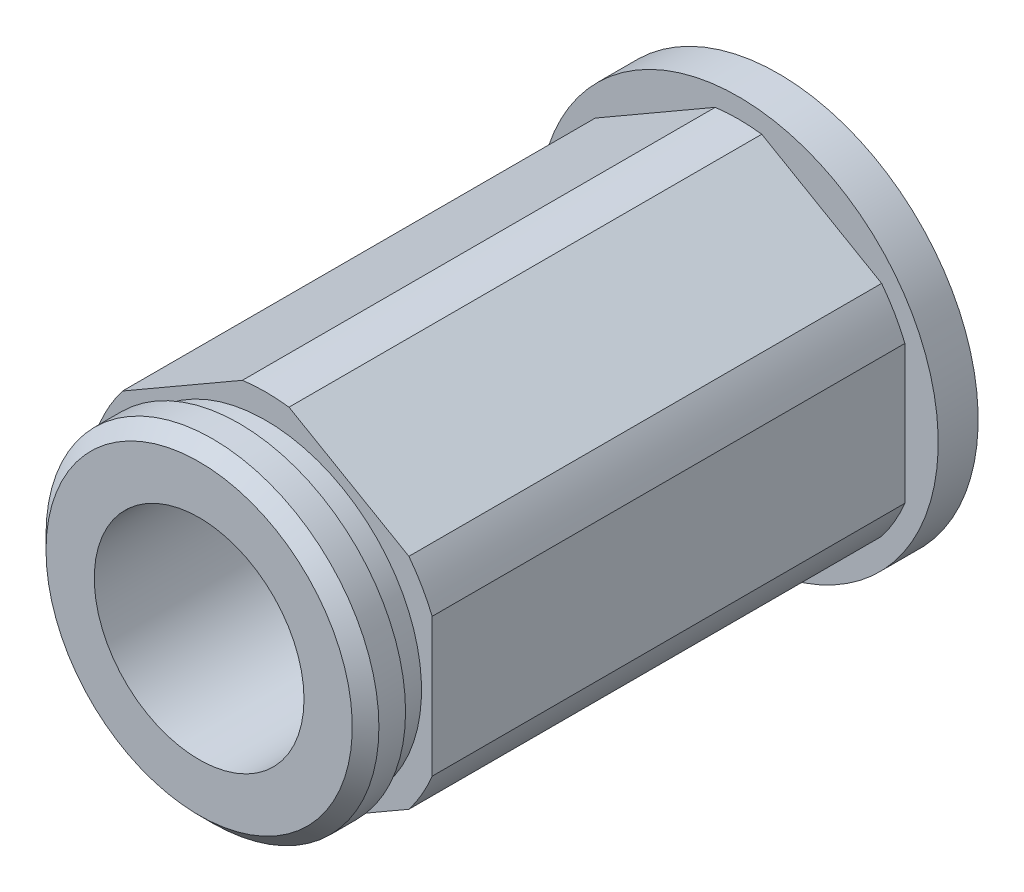
ISO-10303-21;
HEADER;
FILE_DESCRIPTION(('STEP AP214'),'2;1');
FILE_NAME('part.step','',(''),(''),'','','');
FILE_SCHEMA(('AUTOMOTIVE_DESIGN { 1 0 10303 214 1 1 1 1 }'));
ENDSEC;
DATA;
#1=APPLICATION_CONTEXT('core data for automotive mechanical design processes');
#2=APPLICATION_PROTOCOL_DEFINITION('international standard','automotive_design',2000,#1);
#3=PRODUCT_CONTEXT('',#1,'mechanical');
#4=PRODUCT('Part','Part','',(#3));
#5=PRODUCT_RELATED_PRODUCT_CATEGORY('part','',(#4));
#6=PRODUCT_DEFINITION_FORMATION('','',#4);
#7=PRODUCT_DEFINITION_CONTEXT('part definition',#1,'design');
#8=PRODUCT_DEFINITION('design','',#6,#7);
#9=PRODUCT_DEFINITION_SHAPE('','',#8);
#10=(LENGTH_UNIT() NAMED_UNIT(*) SI_UNIT(.MILLI.,.METRE.));
#11=(NAMED_UNIT(*) PLANE_ANGLE_UNIT() SI_UNIT($,.RADIAN.));
#12=(NAMED_UNIT(*) SI_UNIT($,.STERADIAN.) SOLID_ANGLE_UNIT());
#13=UNCERTAINTY_MEASURE_WITH_UNIT(LENGTH_MEASURE(1.E-05),#10,'distance_accuracy_value','');
#14=(GEOMETRIC_REPRESENTATION_CONTEXT(3) GLOBAL_UNCERTAINTY_ASSIGNED_CONTEXT((#13)) GLOBAL_UNIT_ASSIGNED_CONTEXT((#10,
#11,#12)) REPRESENTATION_CONTEXT('',''));
#15=CARTESIAN_POINT('',(0.,0.,0.));
#16=DIRECTION('',(0.,0.,1.));
#17=DIRECTION('',(1.,0.,0.));
#18=AXIS2_PLACEMENT_3D('',#15,#16,#17);
#19=CARTESIAN_POINT('',(-0.88841137786549,6.81942387054648,9.779));
#20=DIRECTION('',(0.5,-0.866025403784439,0.));
#21=DIRECTION('',(0.866025403784439,0.5,0.));
#22=AXIS2_PLACEMENT_3D('',#19,#20,#21);
#23=PLANE('',#22);
#24=DIRECTION('',(0.866025403784439,0.5,0.));
#25=VECTOR('',#24,1.);
#26=CARTESIAN_POINT('',(-0.88841137786549,6.81942387054648,-8.255));
#27=LINE('',#26,#25);
#28=CARTESIAN_POINT('',(-5.46158862213451,4.17909875751589,-8.255));
#29=VERTEX_POINT('',#28);
#30=CARTESIAN_POINT('',(-0.88841137786549,6.81942387054648,-8.255));
#31=VERTEX_POINT('',#30);
#32=EDGE_CURVE('E167',#29,#31,#27,.T.);
#33=ORIENTED_EDGE('',*,*,#32,.F.);
#34=DIRECTION('',(0.,0.,-1.));
#35=VECTOR('',#34,1.);
#36=CARTESIAN_POINT('',(-5.46158862213451,4.17909875751589,9.779));
#37=LINE('',#36,#35);
#38=CARTESIAN_POINT('',(-5.46158862213451,4.17909875751589,9.779));
#39=VERTEX_POINT('',#38);
#40=EDGE_CURVE('E49',#39,#29,#37,.T.);
#41=ORIENTED_EDGE('',*,*,#40,.F.);
#42=DIRECTION('',(-0.866025403784439,-0.5,0.));
#43=VECTOR('',#42,1.);
#44=CARTESIAN_POINT('',(-0.88841137786549,6.81942387054648,9.779));
#45=LINE('',#44,#43);
#46=CARTESIAN_POINT('',(-0.88841137786549,6.81942387054648,9.779));
#47=VERTEX_POINT('',#46);
#48=EDGE_CURVE('E208',#47,#39,#45,.T.);
#49=ORIENTED_EDGE('',*,*,#48,.F.);
#50=DIRECTION('',(0.,0.,-1.));
#51=VECTOR('',#50,1.);
#52=CARTESIAN_POINT('',(-0.88841137786549,6.81942387054648,9.779));
#53=LINE('',#52,#51);
#54=EDGE_CURVE('E11',#47,#31,#53,.T.);
#55=ORIENTED_EDGE('',*,*,#54,.T.);
#56=EDGE_LOOP('',(#33,#41,#49,#55));
#57=FACE_BOUND('',#56,.T.);
#58=ADVANCED_FACE('F41',(#57),#23,.F.);
#59=CARTESIAN_POINT('',(-6.35,2.64032511303059,9.779));
#60=DIRECTION('',(1.,0.,0.));
#61=DIRECTION('',(0.,0.,-1.));
#62=AXIS2_PLACEMENT_3D('',#59,#60,#61);
#63=PLANE('',#62);
#64=DIRECTION('',(0.,1.,0.));
#65=VECTOR('',#64,1.);
#66=CARTESIAN_POINT('',(-6.35,2.64032511303059,-8.255));
#67=LINE('',#66,#65);
#68=CARTESIAN_POINT('',(-6.35,-2.64032511303059,-8.255));
#69=VERTEX_POINT('',#68);
#70=CARTESIAN_POINT('',(-6.35,2.64032511303059,-8.255));
#71=VERTEX_POINT('',#70);
#72=EDGE_CURVE('E178',#69,#71,#67,.T.);
#73=ORIENTED_EDGE('',*,*,#72,.F.);
#74=DIRECTION('',(0.,0.,-1.));
#75=VECTOR('',#74,1.);
#76=CARTESIAN_POINT('',(-6.35,-2.64032511303059,9.779));
#77=LINE('',#76,#75);
#78=CARTESIAN_POINT('',(-6.35,-2.64032511303059,9.779));
#79=VERTEX_POINT('',#78);
#80=EDGE_CURVE('E246',#79,#69,#77,.T.);
#81=ORIENTED_EDGE('',*,*,#80,.F.);
#82=DIRECTION('',(0.,-1.,0.));
#83=VECTOR('',#82,1.);
#84=CARTESIAN_POINT('',(-6.35,2.64032511303059,9.779));
#85=LINE('',#84,#83);
#86=CARTESIAN_POINT('',(-6.35,2.64032511303059,9.779));
#87=VERTEX_POINT('',#86);
#88=EDGE_CURVE('E212',#87,#79,#85,.T.);
#89=ORIENTED_EDGE('',*,*,#88,.F.);
#90=DIRECTION('',(0.,0.,-1.));
#91=VECTOR('',#90,1.);
#92=CARTESIAN_POINT('',(-6.35,2.64032511303059,9.779));
#93=LINE('',#92,#91);
#94=EDGE_CURVE('E249',#87,#71,#93,.T.);
#95=ORIENTED_EDGE('',*,*,#94,.T.);
#96=EDGE_LOOP('',(#73,#81,#89,#95));
#97=FACE_BOUND('',#96,.T.);
#98=ADVANCED_FACE('F260',(#97),#63,.F.);
#99=CARTESIAN_POINT('',(-5.46158862213451,-4.17909875751589,9.779));
#100=DIRECTION('',(0.5,0.866025403784438,0.));
#101=DIRECTION('',(-0.866025403784439,0.5,0.));
#102=AXIS2_PLACEMENT_3D('',#99,#100,#101);
#103=PLANE('',#102);
#104=DIRECTION('',(-0.866025403784439,0.5,0.));
#105=VECTOR('',#104,1.);
#106=CARTESIAN_POINT('',(-5.46158862213451,-4.17909875751589,-8.255));
#107=LINE('',#106,#105);
#108=CARTESIAN_POINT('',(-0.888411377865495,-6.81942387054648,-8.255));
#109=VERTEX_POINT('',#108);
#110=CARTESIAN_POINT('',(-5.46158862213451,-4.17909875751589,-8.255));
#111=VERTEX_POINT('',#110);
#112=EDGE_CURVE('E176',#109,#111,#107,.T.);
#113=ORIENTED_EDGE('',*,*,#112,.F.);
#114=DIRECTION('',(0.,0.,-1.));
#115=VECTOR('',#114,1.);
#116=CARTESIAN_POINT('',(-0.888411377865495,-6.81942387054648,9.779));
#117=LINE('',#116,#115);
#118=CARTESIAN_POINT('',(-0.888411377865495,-6.81942387054648,9.779));
#119=VERTEX_POINT('',#118);
#120=EDGE_CURVE('E240',#119,#109,#117,.T.);
#121=ORIENTED_EDGE('',*,*,#120,.F.);
#122=DIRECTION('',(0.866025403784438,-0.5,0.));
#123=VECTOR('',#122,1.);
#124=CARTESIAN_POINT('',(-5.46158862213451,-4.17909875751589,9.779));
#125=LINE('',#124,#123);
#126=CARTESIAN_POINT('',(-5.46158862213451,-4.17909875751589,9.779));
#127=VERTEX_POINT('',#126);
#128=EDGE_CURVE('E216',#127,#119,#125,.T.);
#129=ORIENTED_EDGE('',*,*,#128,.F.);
#130=DIRECTION('',(0.,0.,-1.));
#131=VECTOR('',#130,1.);
#132=CARTESIAN_POINT('',(-5.46158862213451,-4.17909875751589,9.779));
#133=LINE('',#132,#131);
#134=EDGE_CURVE('E243',#127,#111,#133,.T.);
#135=ORIENTED_EDGE('',*,*,#134,.T.);
#136=EDGE_LOOP('',(#113,#121,#129,#135));
#137=FACE_BOUND('',#136,.T.);
#138=ADVANCED_FACE('F285',(#137),#103,.F.);
#139=CARTESIAN_POINT('',(0.88841137786549,-6.81942387054648,9.779));
#140=DIRECTION('',(-0.5,0.866025403784439,0.));
#141=DIRECTION('',(-0.866025403784439,-0.5,0.));
#142=AXIS2_PLACEMENT_3D('',#139,#140,#141);
#143=PLANE('',#142);
#144=DIRECTION('',(-0.866025403784439,-0.5,0.));
#145=VECTOR('',#144,1.);
#146=CARTESIAN_POINT('',(0.88841137786549,-6.81942387054648,-8.255));
#147=LINE('',#146,#145);
#148=CARTESIAN_POINT('',(5.46158862213451,-4.17909875751589,-8.255));
#149=VERTEX_POINT('',#148);
#150=CARTESIAN_POINT('',(0.888411377865487,-6.81942387054648,-8.255));
#151=VERTEX_POINT('',#150);
#152=EDGE_CURVE('E164',#149,#151,#147,.T.);
#153=ORIENTED_EDGE('',*,*,#152,.F.);
#154=DIRECTION('',(0.,0.,-1.));
#155=VECTOR('',#154,1.);
#156=CARTESIAN_POINT('',(5.46158862213451,-4.17909875751589,9.779));
#157=LINE('',#156,#155);
#158=CARTESIAN_POINT('',(5.46158862213451,-4.17909875751589,9.779));
#159=VERTEX_POINT('',#158);
#160=EDGE_CURVE('E234',#159,#149,#157,.T.);
#161=ORIENTED_EDGE('',*,*,#160,.F.);
#162=DIRECTION('',(0.866025403784439,0.5,0.));
#163=VECTOR('',#162,1.);
#164=CARTESIAN_POINT('',(0.88841137786549,-6.81942387054648,9.779));
#165=LINE('',#164,#163);
#166=CARTESIAN_POINT('',(0.888411377865487,-6.81942387054648,9.779));
#167=VERTEX_POINT('',#166);
#168=EDGE_CURVE('E220',#167,#159,#165,.T.);
#169=ORIENTED_EDGE('',*,*,#168,.F.);
#170=DIRECTION('',(0.,0.,-1.));
#171=VECTOR('',#170,1.);
#172=CARTESIAN_POINT('',(0.888411377865487,-6.81942387054648,9.779));
#173=LINE('',#172,#171);
#174=EDGE_CURVE('E237',#167,#151,#173,.T.);
#175=ORIENTED_EDGE('',*,*,#174,.T.);
#176=EDGE_LOOP('',(#153,#161,#169,#175));
#177=FACE_BOUND('',#176,.T.);
#178=ADVANCED_FACE('F279',(#177),#143,.F.);
#179=CARTESIAN_POINT('',(6.35,-2.64032511303059,9.779));
#180=DIRECTION('',(-1.,0.,0.));
#181=DIRECTION('',(0.,0.,1.));
#182=AXIS2_PLACEMENT_3D('',#179,#180,#181);
#183=PLANE('',#182);
#184=DIRECTION('',(0.,-1.,0.));
#185=VECTOR('',#184,1.);
#186=CARTESIAN_POINT('',(6.35,-2.64032511303059,-8.255));
#187=LINE('',#186,#185);
#188=CARTESIAN_POINT('',(6.35,2.64032511303059,-8.255));
#189=VERTEX_POINT('',#188);
#190=CARTESIAN_POINT('',(6.35,-2.64032511303059,-8.255));
#191=VERTEX_POINT('',#190);
#192=EDGE_CURVE('E145',#189,#191,#187,.T.);
#193=ORIENTED_EDGE('',*,*,#192,.F.);
#194=DIRECTION('',(0.,0.,-1.));
#195=VECTOR('',#194,1.);
#196=CARTESIAN_POINT('',(6.35,2.64032511303059,9.779));
#197=LINE('',#196,#195);
#198=CARTESIAN_POINT('',(6.35,2.64032511303059,9.779));
#199=VERTEX_POINT('',#198);
#200=EDGE_CURVE('E132',#199,#189,#197,.T.);
#201=ORIENTED_EDGE('',*,*,#200,.F.);
#202=DIRECTION('',(0.,1.,0.));
#203=VECTOR('',#202,1.);
#204=CARTESIAN_POINT('',(6.35,-2.64032511303059,9.779));
#205=LINE('',#204,#203);
#206=CARTESIAN_POINT('',(6.35,-2.64032511303059,9.779));
#207=VERTEX_POINT('',#206);
#208=EDGE_CURVE('E225',#207,#199,#205,.T.);
#209=ORIENTED_EDGE('',*,*,#208,.F.);
#210=DIRECTION('',(0.,0.,-1.));
#211=VECTOR('',#210,1.);
#212=CARTESIAN_POINT('',(6.35,-2.64032511303059,9.779));
#213=LINE('',#212,#211);
#214=EDGE_CURVE('E140',#207,#191,#213,.T.);
#215=ORIENTED_EDGE('',*,*,#214,.T.);
#216=EDGE_LOOP('',(#193,#201,#209,#215));
#217=FACE_BOUND('',#216,.T.);
#218=ADVANCED_FACE('F146',(#217),#183,.F.);
#219=CARTESIAN_POINT('',(5.46158862213451,4.17909875751589,9.779));
#220=DIRECTION('',(-0.499999999999999,-0.866025403784439,0.));
#221=DIRECTION('',(0.866025403784439,-0.499999999999999,0.));
#222=AXIS2_PLACEMENT_3D('',#219,#220,#221);
#223=PLANE('',#222);
#224=DIRECTION('',(0.866025403784439,-0.499999999999999,0.));
#225=VECTOR('',#224,1.);
#226=CARTESIAN_POINT('',(5.46158862213451,4.17909875751589,-8.255));
#227=LINE('',#226,#225);
#228=CARTESIAN_POINT('',(0.888411377865485,6.81942387054648,-8.255));
#229=VERTEX_POINT('',#228);
#230=CARTESIAN_POINT('',(5.46158862213451,4.17909875751589,-8.255));
#231=VERTEX_POINT('',#230);
#232=EDGE_CURVE('E56',#229,#231,#227,.T.);
#233=ORIENTED_EDGE('',*,*,#232,.F.);
#234=DIRECTION('',(0.,0.,-1.));
#235=VECTOR('',#234,1.);
#236=CARTESIAN_POINT('',(0.888411377865485,6.81942387054648,9.779));
#237=LINE('',#236,#235);
#238=CARTESIAN_POINT('',(0.888411377865485,6.81942387054648,9.779));
#239=VERTEX_POINT('',#238);
#240=EDGE_CURVE('E230',#239,#229,#237,.T.);
#241=ORIENTED_EDGE('',*,*,#240,.F.);
#242=DIRECTION('',(-0.866025403784439,0.499999999999999,0.));
#243=VECTOR('',#242,1.);
#244=CARTESIAN_POINT('',(5.46158862213451,4.17909875751589,9.779));
#245=LINE('',#244,#243);
#246=CARTESIAN_POINT('',(5.46158862213451,4.17909875751589,9.779));
#247=VERTEX_POINT('',#246);
#248=EDGE_CURVE('E228',#247,#239,#245,.T.);
#249=ORIENTED_EDGE('',*,*,#248,.F.);
#250=DIRECTION('',(0.,0.,-1.));
#251=VECTOR('',#250,1.);
#252=CARTESIAN_POINT('',(5.46158862213451,4.17909875751589,9.779));
#253=LINE('',#252,#251);
#254=EDGE_CURVE('E141',#247,#231,#253,.T.);
#255=ORIENTED_EDGE('',*,*,#254,.T.);
#256=EDGE_LOOP('',(#233,#241,#249,#255));
#257=FACE_BOUND('',#256,.T.);
#258=ADVANCED_FACE('F272',(#257),#223,.F.);
#259=CARTESIAN_POINT('',(0.,0.,9.779));
#260=DIRECTION('',(0.,0.,-1.));
#261=DIRECTION('',(-1.,0.,0.));
#262=AXIS2_PLACEMENT_3D('',#259,#260,#261);
#263=CYLINDRICAL_SURFACE('',#262,6.87705);
#264=CARTESIAN_POINT('',(0.,0.,-8.255));
#265=DIRECTION('',(0.,0.,-1.));
#266=DIRECTION('',(-1.,0.,0.));
#267=AXIS2_PLACEMENT_3D('',#264,#265,#266);
#268=CIRCLE('',#267,6.87705);
#269=EDGE_CURVE('E63',#31,#229,#268,.T.);
#270=ORIENTED_EDGE('',*,*,#269,.F.);
#271=ORIENTED_EDGE('',*,*,#54,.F.);
#272=CARTESIAN_POINT('',(0.,0.,9.779));
#273=DIRECTION('',(0.,0.,1.));
#274=DIRECTION('',(1.,0.,0.));
#275=AXIS2_PLACEMENT_3D('',#272,#273,#274);
#276=CIRCLE('',#275,6.87705);
#277=EDGE_CURVE('E205',#239,#47,#276,.T.);
#278=ORIENTED_EDGE('',*,*,#277,.F.);
#279=ORIENTED_EDGE('',*,*,#240,.T.);
#280=EDGE_LOOP('',(#270,#271,#278,#279));
#281=FACE_BOUND('',#280,.T.);
#282=ADVANCED_FACE('F270',(#281),#263,.T.);
#283=CARTESIAN_POINT('',(0.,0.,9.779));
#284=DIRECTION('',(0.,0.,-1.));
#285=DIRECTION('',(-1.,0.,0.));
#286=AXIS2_PLACEMENT_3D('',#283,#284,#285);
#287=CYLINDRICAL_SURFACE('',#286,6.87705);
#288=CARTESIAN_POINT('',(0.,0.,-8.255));
#289=DIRECTION('',(0.,0.,-1.));
#290=DIRECTION('',(-1.,0.,0.));
#291=AXIS2_PLACEMENT_3D('',#288,#289,#290);
#292=CIRCLE('',#291,6.87705);
#293=EDGE_CURVE('E173',#71,#29,#292,.T.);
#294=ORIENTED_EDGE('',*,*,#293,.F.);
#295=ORIENTED_EDGE('',*,*,#94,.F.);
#296=CARTESIAN_POINT('',(0.,0.,9.779));
#297=DIRECTION('',(0.,0.,1.));
#298=DIRECTION('',(1.,0.,0.));
#299=AXIS2_PLACEMENT_3D('',#296,#297,#298);
#300=CIRCLE('',#299,6.87705);
#301=EDGE_CURVE('E210',#39,#87,#300,.T.);
#302=ORIENTED_EDGE('',*,*,#301,.F.);
#303=ORIENTED_EDGE('',*,*,#40,.T.);
#304=EDGE_LOOP('',(#294,#295,#302,#303));
#305=FACE_BOUND('',#304,.T.);
#306=ADVANCED_FACE('F255',(#305),#287,.T.);
#307=CARTESIAN_POINT('',(0.,0.,9.779));
#308=DIRECTION('',(0.,0.,-1.));
#309=DIRECTION('',(-1.,0.,0.));
#310=AXIS2_PLACEMENT_3D('',#307,#308,#309);
#311=CYLINDRICAL_SURFACE('',#310,6.87705);
#312=CARTESIAN_POINT('',(0.,0.,-8.255));
#313=DIRECTION('',(0.,0.,-1.));
#314=DIRECTION('',(-1.,0.,0.));
#315=AXIS2_PLACEMENT_3D('',#312,#313,#314);
#316=CIRCLE('',#315,6.87705);
#317=EDGE_CURVE('E181',#111,#69,#316,.T.);
#318=ORIENTED_EDGE('',*,*,#317,.F.);
#319=ORIENTED_EDGE('',*,*,#134,.F.);
#320=CARTESIAN_POINT('',(0.,0.,9.779));
#321=DIRECTION('',(0.,0.,1.));
#322=DIRECTION('',(1.,0.,0.));
#323=AXIS2_PLACEMENT_3D('',#320,#321,#322);
#324=CIRCLE('',#323,6.87705);
#325=EDGE_CURVE('E214',#79,#127,#324,.T.);
#326=ORIENTED_EDGE('',*,*,#325,.F.);
#327=ORIENTED_EDGE('',*,*,#80,.T.);
#328=EDGE_LOOP('',(#318,#319,#326,#327));
#329=FACE_BOUND('',#328,.T.);
#330=ADVANCED_FACE('F264',(#329),#311,.T.);
#331=CARTESIAN_POINT('',(0.,0.,9.779));
#332=DIRECTION('',(0.,0.,-1.));
#333=DIRECTION('',(-1.,0.,0.));
#334=AXIS2_PLACEMENT_3D('',#331,#332,#333);
#335=CYLINDRICAL_SURFACE('',#334,6.87705);
#336=CARTESIAN_POINT('',(0.,0.,-8.255));
#337=DIRECTION('',(0.,0.,-1.));
#338=DIRECTION('',(-1.,0.,0.));
#339=AXIS2_PLACEMENT_3D('',#336,#337,#338);
#340=CIRCLE('',#339,6.87705);
#341=EDGE_CURVE('E170',#151,#109,#340,.T.);
#342=ORIENTED_EDGE('',*,*,#341,.F.);
#343=ORIENTED_EDGE('',*,*,#174,.F.);
#344=CARTESIAN_POINT('',(0.,0.,9.779));
#345=DIRECTION('',(0.,0.,1.));
#346=DIRECTION('',(1.,0.,0.));
#347=AXIS2_PLACEMENT_3D('',#344,#345,#346);
#348=CIRCLE('',#347,6.87705);
#349=EDGE_CURVE('E218',#119,#167,#348,.T.);
#350=ORIENTED_EDGE('',*,*,#349,.F.);
#351=ORIENTED_EDGE('',*,*,#120,.T.);
#352=EDGE_LOOP('',(#342,#343,#350,#351));
#353=FACE_BOUND('',#352,.T.);
#354=ADVANCED_FACE('F283',(#353),#335,.T.);
#355=CARTESIAN_POINT('',(0.,0.,9.779));
#356=DIRECTION('',(0.,0.,-1.));
#357=DIRECTION('',(-1.,0.,0.));
#358=AXIS2_PLACEMENT_3D('',#355,#356,#357);
#359=CYLINDRICAL_SURFACE('',#358,6.87705);
#360=CARTESIAN_POINT('',(0.,0.,-8.255));
#361=DIRECTION('',(0.,0.,-1.));
#362=DIRECTION('',(-1.,0.,0.));
#363=AXIS2_PLACEMENT_3D('',#360,#361,#362);
#364=CIRCLE('',#363,6.87705);
#365=EDGE_CURVE('E150',#191,#149,#364,.T.);
#366=ORIENTED_EDGE('',*,*,#365,.F.);
#367=ORIENTED_EDGE('',*,*,#214,.F.);
#368=CARTESIAN_POINT('',(0.,0.,9.779));
#369=DIRECTION('',(0.,0.,1.));
#370=DIRECTION('',(1.,0.,0.));
#371=AXIS2_PLACEMENT_3D('',#368,#369,#370);
#372=CIRCLE('',#371,6.87705);
#373=EDGE_CURVE('E222',#159,#207,#372,.T.);
#374=ORIENTED_EDGE('',*,*,#373,.F.);
#375=ORIENTED_EDGE('',*,*,#160,.T.);
#376=EDGE_LOOP('',(#366,#367,#374,#375));
#377=FACE_BOUND('',#376,.T.);
#378=ADVANCED_FACE('F277',(#377),#359,.T.);
#379=CARTESIAN_POINT('',(0.,0.,9.779));
#380=DIRECTION('',(0.,0.,-1.));
#381=DIRECTION('',(-1.,0.,0.));
#382=AXIS2_PLACEMENT_3D('',#379,#380,#381);
#383=CYLINDRICAL_SURFACE('',#382,6.87705);
#384=CARTESIAN_POINT('',(0.,0.,-8.255));
#385=DIRECTION('',(0.,0.,-1.));
#386=DIRECTION('',(-1.,0.,0.));
#387=AXIS2_PLACEMENT_3D('',#384,#385,#386);
#388=CIRCLE('',#387,6.87705);
#389=EDGE_CURVE('E137',#231,#189,#388,.T.);
#390=ORIENTED_EDGE('',*,*,#389,.F.);
#391=ORIENTED_EDGE('',*,*,#254,.F.);
#392=CARTESIAN_POINT('',(0.,0.,9.779));
#393=DIRECTION('',(0.,0.,1.));
#394=DIRECTION('',(1.,0.,0.));
#395=AXIS2_PLACEMENT_3D('',#392,#393,#394);
#396=CIRCLE('',#395,6.87705);
#397=EDGE_CURVE('E138',#199,#247,#396,.T.);
#398=ORIENTED_EDGE('',*,*,#397,.F.);
#399=ORIENTED_EDGE('',*,*,#200,.T.);
#400=EDGE_LOOP('',(#390,#391,#398,#399));
#401=FACE_BOUND('',#400,.T.);
#402=ADVANCED_FACE('F134',(#401),#383,.T.);
#403=CARTESIAN_POINT('',(0.,0.,9.779));
#404=DIRECTION('',(0.,0.,1.));
#405=DIRECTION('',(1.,0.,0.));
#406=AXIS2_PLACEMENT_3D('',#403,#404,#405);
#407=PLANE('',#406);
#408=CARTESIAN_POINT('',(0.,0.,9.779));
#409=DIRECTION('',(0.,0.,-1.));
#410=DIRECTION('',(-1.,0.,0.));
#411=AXIS2_PLACEMENT_3D('',#408,#409,#410);
#412=CIRCLE('',#411,5.9436);
#413=CARTESIAN_POINT('',(-5.9436,0.,9.779));
#414=VERTEX_POINT('',#413);
#415=EDGE_CURVE('E202',#414,#414,#412,.T.);
#416=ORIENTED_EDGE('',*,*,#415,.T.);
#417=EDGE_LOOP('',(#416));
#418=FACE_BOUND('',#417,.T.);
#419=ORIENTED_EDGE('',*,*,#373,.T.);
#420=ORIENTED_EDGE('',*,*,#208,.T.);
#421=ORIENTED_EDGE('',*,*,#397,.T.);
#422=ORIENTED_EDGE('',*,*,#248,.T.);
#423=ORIENTED_EDGE('',*,*,#277,.T.);
#424=ORIENTED_EDGE('',*,*,#48,.T.);
#425=ORIENTED_EDGE('',*,*,#301,.T.);
#426=ORIENTED_EDGE('',*,*,#88,.T.);
#427=ORIENTED_EDGE('',*,*,#325,.T.);
#428=ORIENTED_EDGE('',*,*,#128,.T.);
#429=ORIENTED_EDGE('',*,*,#349,.T.);
#430=ORIENTED_EDGE('',*,*,#168,.T.);
#431=EDGE_LOOP('',(#419,#420,#421,#422,#423,#424,#425,#426,#427,#428,#429,#430));
#432=FACE_BOUND('',#431,.T.);
#433=ADVANCED_FACE('F43',(#418,#432),#407,.T.);
#434=CARTESIAN_POINT('',(0.,0.,-9.779));
#435=DIRECTION('',(0.,0.,1.));
#436=DIRECTION('',(1.,0.,0.));
#437=AXIS2_PLACEMENT_3D('',#434,#435,#436);
#438=PLANE('',#437);
#439=CARTESIAN_POINT('',(0.,0.,-9.779));
#440=DIRECTION('',(0.,0.,1.));
#441=DIRECTION('',(1.,0.,0.));
#442=AXIS2_PLACEMENT_3D('',#439,#440,#441);
#443=CIRCLE('',#442,4.0005);
#444=CARTESIAN_POINT('',(4.0005,0.,-9.779));
#445=VERTEX_POINT('',#444);
#446=EDGE_CURVE('E187',#445,#445,#443,.T.);
#447=ORIENTED_EDGE('',*,*,#446,.T.);
#448=EDGE_LOOP('',(#447));
#449=FACE_BOUND('',#448,.T.);
#450=CARTESIAN_POINT('',(0.,0.,-9.779));
#451=DIRECTION('',(0.,0.,-1.));
#452=DIRECTION('',(-1.,0.,0.));
#453=AXIS2_PLACEMENT_3D('',#450,#451,#452);
#454=CIRCLE('',#453,7.62);
#455=CARTESIAN_POINT('',(-7.62,0.,-9.779));
#456=VERTEX_POINT('',#455);
#457=EDGE_CURVE('E158',#456,#456,#454,.T.);
#458=ORIENTED_EDGE('',*,*,#457,.T.);
#459=EDGE_LOOP('',(#458));
#460=FACE_BOUND('',#459,.T.);
#461=ADVANCED_FACE('F303',(#449,#460),#438,.F.);
#462=CARTESIAN_POINT('',(0.,0.,-38.2778));
#463=DIRECTION('',(0.,0.,-1.));
#464=DIRECTION('',(-1.,0.,0.));
#465=AXIS2_PLACEMENT_3D('',#462,#463,#464);
#466=CYLINDRICAL_SURFACE('',#465,5.9436);
#467=CARTESIAN_POINT('',(0.,0.,10.795));
#468=DIRECTION('',(0.,0.,-1.));
#469=DIRECTION('',(-1.,0.,0.));
#470=AXIS2_PLACEMENT_3D('',#467,#468,#469);
#471=CIRCLE('',#470,5.9436);
#472=CARTESIAN_POINT('',(-5.9436,0.,10.795));
#473=VERTEX_POINT('',#472);
#474=EDGE_CURVE('E199',#473,#473,#471,.T.);
#475=ORIENTED_EDGE('',*,*,#474,.T.);
#476=EDGE_LOOP('',(#475));
#477=FACE_BOUND('',#476,.T.);
#478=ORIENTED_EDGE('',*,*,#415,.F.);
#479=EDGE_LOOP('',(#478));
#480=FACE_BOUND('',#479,.T.);
#481=ADVANCED_FACE('F305',(#477,#480),#466,.T.);
#482=CARTESIAN_POINT('',(0.,5.9436,10.795));
#483=DIRECTION('',(0.,0.,-1.));
#484=DIRECTION('',(-1.,0.,0.));
#485=AXIS2_PLACEMENT_3D('',#482,#483,#484);
#486=PLANE('',#485);
#487=CARTESIAN_POINT('',(0.,0.,10.795));
#488=DIRECTION('',(0.,0.,-1.));
#489=DIRECTION('',(-1.,0.,0.));
#490=AXIS2_PLACEMENT_3D('',#487,#488,#489);
#491=CIRCLE('',#490,6.35);
#492=CARTESIAN_POINT('',(-6.35,0.,10.795));
#493=VERTEX_POINT('',#492);
#494=EDGE_CURVE('E196',#493,#493,#491,.T.);
#495=ORIENTED_EDGE('',*,*,#494,.T.);
#496=EDGE_LOOP('',(#495));
#497=FACE_BOUND('',#496,.T.);
#498=ORIENTED_EDGE('',*,*,#474,.F.);
#499=EDGE_LOOP('',(#498));
#500=FACE_BOUND('',#499,.T.);
#501=ADVANCED_FACE('F311',(#497,#500),#486,.T.);
#502=CARTESIAN_POINT('',(0.,0.,-38.2778));
#503=DIRECTION('',(0.,0.,-1.));
#504=DIRECTION('',(-1.,0.,0.));
#505=AXIS2_PLACEMENT_3D('',#502,#503,#504);
#506=CYLINDRICAL_SURFACE('',#505,6.35);
#507=CARTESIAN_POINT('',(0.,0.,11.811));
#508=DIRECTION('',(0.,0.,-1.));
#509=DIRECTION('',(-1.,0.,0.));
#510=AXIS2_PLACEMENT_3D('',#507,#508,#509);
#511=CIRCLE('',#510,6.35);
#512=CARTESIAN_POINT('',(-6.35,0.,11.811));
#513=VERTEX_POINT('',#512);
#514=EDGE_CURVE('E193',#513,#513,#511,.T.);
#515=ORIENTED_EDGE('',*,*,#514,.T.);
#516=EDGE_LOOP('',(#515));
#517=FACE_BOUND('',#516,.T.);
#518=ORIENTED_EDGE('',*,*,#494,.F.);
#519=EDGE_LOOP('',(#518));
#520=FACE_BOUND('',#519,.T.);
#521=ADVANCED_FACE('F341',(#517,#520),#506,.T.);
#522=CARTESIAN_POINT('',(0.,0.,11.811));
#523=DIRECTION('',(0.,0.,-1.));
#524=DIRECTION('',(-1.,0.,0.));
#525=AXIS2_PLACEMENT_3D('',#522,#523,#524);
#526=CONICAL_SURFACE('',#525,6.35,0.785398163397453);
#527=CARTESIAN_POINT('',(0.,0.,12.319));
#528=DIRECTION('',(0.,0.,-1.));
#529=DIRECTION('',(-1.,0.,0.));
#530=AXIS2_PLACEMENT_3D('',#527,#528,#529);
#531=CIRCLE('',#530,5.842);
#532=CARTESIAN_POINT('',(-5.842,0.,12.319));
#533=VERTEX_POINT('',#532);
#534=EDGE_CURVE('E190',#533,#533,#531,.T.);
#535=ORIENTED_EDGE('',*,*,#534,.T.);
#536=EDGE_LOOP('',(#535));
#537=FACE_BOUND('',#536,.T.);
#538=ORIENTED_EDGE('',*,*,#514,.F.);
#539=EDGE_LOOP('',(#538));
#540=FACE_BOUND('',#539,.T.);
#541=ADVANCED_FACE('F337',(#537,#540),#526,.T.);
#542=CARTESIAN_POINT('',(0.,5.842,12.319));
#543=DIRECTION('',(0.,0.,1.));
#544=DIRECTION('',(1.,0.,0.));
#545=AXIS2_PLACEMENT_3D('',#542,#543,#544);
#546=PLANE('',#545);
#547=CARTESIAN_POINT('',(0.,0.,12.319));
#548=DIRECTION('',(0.,0.,1.));
#549=DIRECTION('',(1.,0.,0.));
#550=AXIS2_PLACEMENT_3D('',#547,#548,#549);
#551=CIRCLE('',#550,4.0005);
#552=CARTESIAN_POINT('',(4.0005,0.,12.319));
#553=VERTEX_POINT('',#552);
#554=EDGE_CURVE('E184',#553,#553,#551,.T.);
#555=ORIENTED_EDGE('',*,*,#554,.F.);
#556=EDGE_LOOP('',(#555));
#557=FACE_BOUND('',#556,.T.);
#558=ORIENTED_EDGE('',*,*,#534,.F.);
#559=EDGE_LOOP('',(#558));
#560=FACE_BOUND('',#559,.T.);
#561=ADVANCED_FACE('F333',(#557,#560),#546,.T.);
#562=CARTESIAN_POINT('',(0.,0.,-9.779));
#563=DIRECTION('',(0.,0.,1.));
#564=DIRECTION('',(1.,0.,0.));
#565=AXIS2_PLACEMENT_3D('',#562,#563,#564);
#566=CYLINDRICAL_SURFACE('',#565,4.0005);
#567=ORIENTED_EDGE('',*,*,#446,.F.);
#568=EDGE_LOOP('',(#567));
#569=FACE_BOUND('',#568,.T.);
#570=ORIENTED_EDGE('',*,*,#554,.T.);
#571=EDGE_LOOP('',(#570));
#572=FACE_BOUND('',#571,.T.);
#573=ADVANCED_FACE('F327',(#569,#572),#566,.F.);
#574=CARTESIAN_POINT('',(0.,0.,-8.255));
#575=DIRECTION('',(0.,0.,-1.));
#576=DIRECTION('',(-1.,0.,0.));
#577=AXIS2_PLACEMENT_3D('',#574,#575,#576);
#578=PLANE('',#577);
#579=CARTESIAN_POINT('',(0.,0.,-8.255));
#580=DIRECTION('',(0.,0.,-1.));
#581=DIRECTION('',(-1.,0.,0.));
#582=AXIS2_PLACEMENT_3D('',#579,#580,#581);
#583=CIRCLE('',#582,7.62);
#584=CARTESIAN_POINT('',(-7.62,0.,-8.255));
#585=VERTEX_POINT('',#584);
#586=EDGE_CURVE('E154',#585,#585,#583,.T.);
#587=ORIENTED_EDGE('',*,*,#586,.F.);
#588=EDGE_LOOP('',(#587));
#589=FACE_BOUND('',#588,.T.);
#590=ORIENTED_EDGE('',*,*,#112,.T.);
#591=ORIENTED_EDGE('',*,*,#317,.T.);
#592=ORIENTED_EDGE('',*,*,#72,.T.);
#593=ORIENTED_EDGE('',*,*,#293,.T.);
#594=ORIENTED_EDGE('',*,*,#32,.T.);
#595=ORIENTED_EDGE('',*,*,#269,.T.);
#596=ORIENTED_EDGE('',*,*,#232,.T.);
#597=ORIENTED_EDGE('',*,*,#389,.T.);
#598=ORIENTED_EDGE('',*,*,#192,.T.);
#599=ORIENTED_EDGE('',*,*,#365,.T.);
#600=ORIENTED_EDGE('',*,*,#152,.T.);
#601=ORIENTED_EDGE('',*,*,#341,.T.);
#602=EDGE_LOOP('',(#590,#591,#592,#593,#594,#595,#596,#597,#598,#599,#600,#601));
#603=FACE_BOUND('',#602,.T.);
#604=ADVANCED_FACE('F153',(#589,#603),#578,.F.);
#605=CARTESIAN_POINT('',(0.,0.,-8.255));
#606=DIRECTION('',(0.,0.,-1.));
#607=DIRECTION('',(-1.,0.,0.));
#608=AXIS2_PLACEMENT_3D('',#605,#606,#607);
#609=CYLINDRICAL_SURFACE('',#608,7.62);
#610=ORIENTED_EDGE('',*,*,#586,.T.);
#611=EDGE_LOOP('',(#610));
#612=FACE_BOUND('',#611,.T.);
#613=ORIENTED_EDGE('',*,*,#457,.F.);
#614=EDGE_LOOP('',(#613));
#615=FACE_BOUND('',#614,.T.);
#616=ADVANCED_FACE('F320',(#612,#615),#609,.T.);
#617=CLOSED_SHELL('',(#58,#98,#138,#178,#218,#258,#282,#306,#330,#354,#378,#402,#433,#461,#481,
#501,#521,#541,#561,#573,#604,#616));
#618=MANIFOLD_SOLID_BREP('B2',#617);
#619=ADVANCED_BREP_SHAPE_REPRESENTATION('',(#18,#618),#14);
#620=SHAPE_DEFINITION_REPRESENTATION(#9,#619);
ENDSEC;
END-ISO-10303-21;
